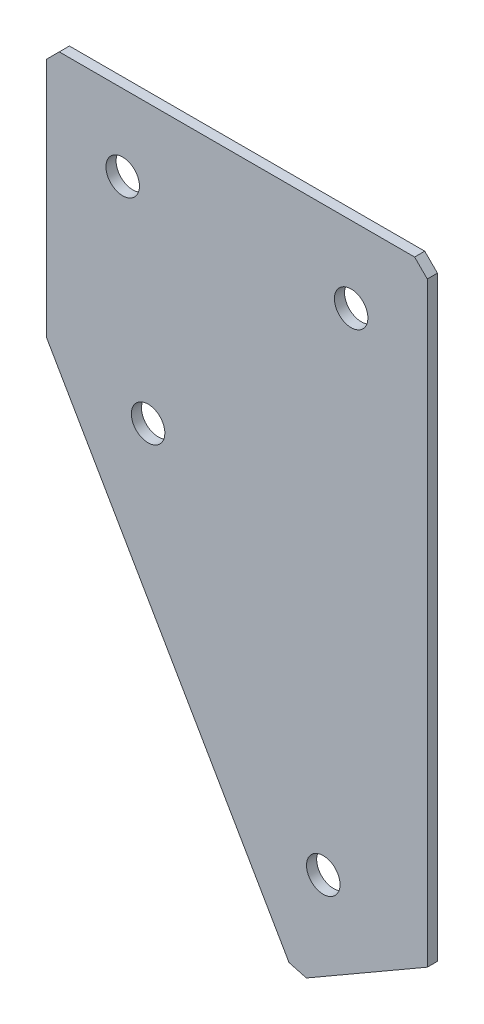
ISO-10303-21;
HEADER;
FILE_DESCRIPTION(('STEP AP214'),'2;1');
FILE_NAME('part.step','',(''),(''),'','','');
FILE_SCHEMA(('AUTOMOTIVE_DESIGN { 1 0 10303 214 1 1 1 1 }'));
ENDSEC;
DATA;
#1=APPLICATION_CONTEXT('core data for automotive mechanical design processes');
#2=APPLICATION_PROTOCOL_DEFINITION('international standard','automotive_design',2000,#1);
#3=PRODUCT_CONTEXT('',#1,'mechanical');
#4=PRODUCT('Part','Part','',(#3));
#5=PRODUCT_RELATED_PRODUCT_CATEGORY('part','',(#4));
#6=PRODUCT_DEFINITION_FORMATION('','',#4);
#7=PRODUCT_DEFINITION_CONTEXT('part definition',#1,'design');
#8=PRODUCT_DEFINITION('design','',#6,#7);
#9=PRODUCT_DEFINITION_SHAPE('','',#8);
#10=(LENGTH_UNIT() NAMED_UNIT(*) SI_UNIT(.MILLI.,.METRE.));
#11=(NAMED_UNIT(*) PLANE_ANGLE_UNIT() SI_UNIT($,.RADIAN.));
#12=(NAMED_UNIT(*) SI_UNIT($,.STERADIAN.) SOLID_ANGLE_UNIT());
#13=UNCERTAINTY_MEASURE_WITH_UNIT(LENGTH_MEASURE(1.E-05),#10,'distance_accuracy_value','');
#14=(GEOMETRIC_REPRESENTATION_CONTEXT(3) GLOBAL_UNCERTAINTY_ASSIGNED_CONTEXT((#13)) GLOBAL_UNIT_ASSIGNED_CONTEXT((#10,
#11,#12)) REPRESENTATION_CONTEXT('',''));
#15=CARTESIAN_POINT('',(0.,0.,0.));
#16=DIRECTION('',(0.,0.,1.));
#17=DIRECTION('',(1.,0.,0.));
#18=AXIS2_PLACEMENT_3D('',#15,#16,#17);
#19=CARTESIAN_POINT('',(0.,0.,-2.));
#20=DIRECTION('',(1.,0.,0.));
#21=DIRECTION('',(0.,0.,-1.));
#22=AXIS2_PLACEMENT_3D('',#19,#20,#21);
#23=PLANE('',#22);
#24=DIRECTION('',(0.,1.,0.));
#25=VECTOR('',#24,1.);
#26=CARTESIAN_POINT('',(0.,0.,0.));
#27=LINE('',#26,#25);
#28=CARTESIAN_POINT('',(0.,-50.,0.));
#29=VERTEX_POINT('',#28);
#30=CARTESIAN_POINT('',(0.,-2.50000000000003,0.));
#31=VERTEX_POINT('',#30);
#32=EDGE_CURVE('E130',#29,#31,#27,.T.);
#33=ORIENTED_EDGE('',*,*,#32,.T.);
#34=DIRECTION('',(0.,0.,-1.));
#35=VECTOR('',#34,1.);
#36=CARTESIAN_POINT('',(0.,-2.50000000000003,-2.));
#37=LINE('',#36,#35);
#38=CARTESIAN_POINT('',(0.,-2.50000000000003,-2.));
#39=VERTEX_POINT('',#38);
#40=EDGE_CURVE('E11',#31,#39,#37,.T.);
#41=ORIENTED_EDGE('',*,*,#40,.T.);
#42=DIRECTION('',(0.,1.,0.));
#43=VECTOR('',#42,1.);
#44=CARTESIAN_POINT('',(0.,0.,-2.));
#45=LINE('',#44,#43);
#46=CARTESIAN_POINT('',(0.,-50.,-2.));
#47=VERTEX_POINT('',#46);
#48=EDGE_CURVE('E141',#47,#39,#45,.T.);
#49=ORIENTED_EDGE('',*,*,#48,.F.);
#50=DIRECTION('',(0.,0.,1.));
#51=VECTOR('',#50,1.);
#52=CARTESIAN_POINT('',(0.,-50.,-2.));
#53=LINE('',#52,#51);
#54=EDGE_CURVE('E120',#47,#29,#53,.T.);
#55=ORIENTED_EDGE('',*,*,#54,.T.);
#56=EDGE_LOOP('',(#33,#41,#49,#55));
#57=FACE_BOUND('',#56,.T.);
#58=ADVANCED_FACE('F37',(#57),#23,.F.);
#59=CARTESIAN_POINT('',(0.,0.,-2.));
#60=DIRECTION('',(0.,-1.,0.));
#61=DIRECTION('',(0.,0.,-1.));
#62=AXIS2_PLACEMENT_3D('',#59,#60,#61);
#63=PLANE('',#62);
#64=DIRECTION('',(1.,0.,0.));
#65=VECTOR('',#64,1.);
#66=CARTESIAN_POINT('',(0.,0.,0.));
#67=LINE('',#66,#65);
#68=CARTESIAN_POINT('',(2.50000000000003,0.,0.));
#69=VERTEX_POINT('',#68);
#70=CARTESIAN_POINT('',(72.5,0.,0.));
#71=VERTEX_POINT('',#70);
#72=EDGE_CURVE('E133',#69,#71,#67,.T.);
#73=ORIENTED_EDGE('',*,*,#72,.T.);
#74=DIRECTION('',(0.,0.,-1.));
#75=VECTOR('',#74,1.);
#76=CARTESIAN_POINT('',(72.5,0.,-2.));
#77=LINE('',#76,#75);
#78=CARTESIAN_POINT('',(72.5,0.,-2.));
#79=VERTEX_POINT('',#78);
#80=EDGE_CURVE('E45',#71,#79,#77,.T.);
#81=ORIENTED_EDGE('',*,*,#80,.T.);
#82=DIRECTION('',(1.,0.,0.));
#83=VECTOR('',#82,1.);
#84=CARTESIAN_POINT('',(0.,0.,-2.));
#85=LINE('',#84,#83);
#86=CARTESIAN_POINT('',(2.50000000000003,0.,-2.));
#87=VERTEX_POINT('',#86);
#88=EDGE_CURVE('E109',#87,#79,#85,.T.);
#89=ORIENTED_EDGE('',*,*,#88,.F.);
#90=DIRECTION('',(0.,0.,1.));
#91=VECTOR('',#90,1.);
#92=CARTESIAN_POINT('',(2.50000000000003,0.,-2.));
#93=LINE('',#92,#91);
#94=EDGE_CURVE('E160',#87,#69,#93,.T.);
#95=ORIENTED_EDGE('',*,*,#94,.T.);
#96=EDGE_LOOP('',(#73,#81,#89,#95));
#97=FACE_BOUND('',#96,.T.);
#98=ADVANCED_FACE('F164',(#97),#63,.F.);
#99=CARTESIAN_POINT('',(75.,0.,-2.));
#100=DIRECTION('',(-1.,0.,0.));
#101=DIRECTION('',(0.,-1.,0.));
#102=AXIS2_PLACEMENT_3D('',#99,#100,#101);
#103=PLANE('',#102);
#104=DIRECTION('',(0.,-1.,0.));
#105=VECTOR('',#104,1.);
#106=CARTESIAN_POINT('',(75.,0.,-2.));
#107=LINE('',#106,#105);
#108=CARTESIAN_POINT('',(75.,-2.50000000000002,-2.));
#109=VERTEX_POINT('',#108);
#110=CARTESIAN_POINT('',(75.0000000000002,-119.903810567667,-2.));
#111=VERTEX_POINT('',#110);
#112=EDGE_CURVE('E100',#109,#111,#107,.T.);
#113=ORIENTED_EDGE('',*,*,#112,.F.);
#114=DIRECTION('',(0.,0.,1.));
#115=VECTOR('',#114,1.);
#116=CARTESIAN_POINT('',(75.,-2.50000000000002,-2.));
#117=LINE('',#116,#115);
#118=CARTESIAN_POINT('',(75.,-2.50000000000002,0.));
#119=VERTEX_POINT('',#118);
#120=EDGE_CURVE('E158',#109,#119,#117,.T.);
#121=ORIENTED_EDGE('',*,*,#120,.T.);
#122=DIRECTION('',(0.,-1.,0.));
#123=VECTOR('',#122,1.);
#124=CARTESIAN_POINT('',(75.,0.,0.));
#125=LINE('',#124,#123);
#126=CARTESIAN_POINT('',(75.0000000000002,-119.903810567667,0.));
#127=VERTEX_POINT('',#126);
#128=EDGE_CURVE('E115',#119,#127,#125,.T.);
#129=ORIENTED_EDGE('',*,*,#128,.T.);
#130=DIRECTION('',(0.,0.,1.));
#131=VECTOR('',#130,1.);
#132=CARTESIAN_POINT('',(75.0000000000002,-119.903810567667,-2.));
#133=LINE('',#132,#131);
#134=EDGE_CURVE('E112',#111,#127,#133,.T.);
#135=ORIENTED_EDGE('',*,*,#134,.F.);
#136=EDGE_LOOP('',(#113,#121,#129,#135));
#137=FACE_BOUND('',#136,.T.);
#138=ADVANCED_FACE('F113',(#137),#103,.F.);
#139=CARTESIAN_POINT('',(49.019237886467,-134.903810567667,-2.));
#140=DIRECTION('',(-0.499999999999997,0.86602540378444,0.));
#141=DIRECTION('',(-0.86602540378444,-0.499999999999997,0.));
#142=AXIS2_PLACEMENT_3D('',#139,#140,#141);
#143=PLANE('',#142);
#144=DIRECTION('',(-0.86602540378444,-0.499999999999997,0.));
#145=VECTOR('',#144,1.);
#146=CARTESIAN_POINT('',(49.019237886467,-134.903810567667,0.));
#147=LINE('',#146,#145);
#148=CARTESIAN_POINT('',(51.1843013959282,-133.653810567667,0.));
#149=VERTEX_POINT('',#148);
#150=EDGE_CURVE('E137',#127,#149,#147,.T.);
#151=ORIENTED_EDGE('',*,*,#150,.T.);
#152=DIRECTION('',(0.,0.,-1.));
#153=VECTOR('',#152,1.);
#154=CARTESIAN_POINT('',(51.1843013959282,-133.653810567667,-2.));
#155=LINE('',#154,#153);
#156=CARTESIAN_POINT('',(51.1843013959282,-133.653810567667,-2.));
#157=VERTEX_POINT('',#156);
#158=EDGE_CURVE('E124',#149,#157,#155,.T.);
#159=ORIENTED_EDGE('',*,*,#158,.T.);
#160=DIRECTION('',(-0.86602540378444,-0.499999999999997,0.));
#161=VECTOR('',#160,1.);
#162=CARTESIAN_POINT('',(49.019237886467,-134.903810567667,-2.));
#163=LINE('',#162,#161);
#164=EDGE_CURVE('E104',#111,#157,#163,.T.);
#165=ORIENTED_EDGE('',*,*,#164,.F.);
#166=ORIENTED_EDGE('',*,*,#134,.T.);
#167=EDGE_LOOP('',(#151,#159,#165,#166));
#168=FACE_BOUND('',#167,.T.);
#169=ADVANCED_FACE('F122',(#168),#143,.F.);
#170=CARTESIAN_POINT('',(0.,-50.,-2.));
#171=DIRECTION('',(0.86602540378444,0.499999999999998,0.));
#172=DIRECTION('',(-0.499999999999998,0.86602540378444,0.));
#173=AXIS2_PLACEMENT_3D('',#170,#171,#172);
#174=PLANE('',#173);
#175=DIRECTION('',(-0.499999999999998,0.86602540378444,0.));
#176=VECTOR('',#175,1.);
#177=CARTESIAN_POINT('',(0.,-50.,-2.));
#178=LINE('',#177,#176);
#179=CARTESIAN_POINT('',(47.769237886467,-132.738747058205,-2.));
#180=VERTEX_POINT('',#179);
#181=EDGE_CURVE('E125',#180,#47,#178,.T.);
#182=ORIENTED_EDGE('',*,*,#181,.F.);
#183=DIRECTION('',(0.,0.,1.));
#184=VECTOR('',#183,1.);
#185=CARTESIAN_POINT('',(47.769237886467,-132.738747058205,-2.));
#186=LINE('',#185,#184);
#187=CARTESIAN_POINT('',(47.769237886467,-132.738747058205,0.));
#188=VERTEX_POINT('',#187);
#189=EDGE_CURVE('E119',#180,#188,#186,.T.);
#190=ORIENTED_EDGE('',*,*,#189,.T.);
#191=DIRECTION('',(-0.499999999999998,0.86602540378444,0.));
#192=VECTOR('',#191,1.);
#193=CARTESIAN_POINT('',(0.,-50.,0.));
#194=LINE('',#193,#192);
#195=EDGE_CURVE('E139',#188,#29,#194,.T.);
#196=ORIENTED_EDGE('',*,*,#195,.T.);
#197=ORIENTED_EDGE('',*,*,#54,.F.);
#198=EDGE_LOOP('',(#182,#190,#196,#197));
#199=FACE_BOUND('',#198,.T.);
#200=ADVANCED_FACE('F194',(#199),#174,.F.);
#201=CARTESIAN_POINT('',(0.,0.,-2.));
#202=DIRECTION('',(0.,0.,1.));
#203=DIRECTION('',(1.,0.,0.));
#204=AXIS2_PLACEMENT_3D('',#201,#202,#203);
#205=PLANE('',#204);
#206=CARTESIAN_POINT('',(15.,-15.,-2.));
#207=DIRECTION('',(0.,0.,-1.));
#208=DIRECTION('',(0.,1.,0.));
#209=AXIS2_PLACEMENT_3D('',#206,#207,#208);
#210=CIRCLE('',#209,3.3);
#211=CARTESIAN_POINT('',(15.,-11.7,-2.));
#212=VERTEX_POINT('',#211);
#213=EDGE_CURVE('E226',#212,#212,#210,.T.);
#214=ORIENTED_EDGE('',*,*,#213,.F.);
#215=EDGE_LOOP('',(#214));
#216=FACE_BOUND('',#215,.T.);
#217=CARTESIAN_POINT('',(60.,-15.,-2.));
#218=DIRECTION('',(0.,0.,-1.));
#219=DIRECTION('',(0.,1.,0.));
#220=AXIS2_PLACEMENT_3D('',#217,#218,#219);
#221=CIRCLE('',#220,3.3);
#222=CARTESIAN_POINT('',(60.,-11.7,-2.));
#223=VERTEX_POINT('',#222);
#224=EDGE_CURVE('E228',#223,#223,#221,.T.);
#225=ORIENTED_EDGE('',*,*,#224,.F.);
#226=EDGE_LOOP('',(#225));
#227=FACE_BOUND('',#226,.T.);
#228=CARTESIAN_POINT('',(20.,-54.641016151378,-2.));
#229=DIRECTION('',(0.,0.,-1.));
#230=DIRECTION('',(0.,1.,0.));
#231=AXIS2_PLACEMENT_3D('',#228,#229,#230);
#232=CIRCLE('',#231,3.3);
#233=CARTESIAN_POINT('',(20.,-51.341016151378,-2.));
#234=VERTEX_POINT('',#233);
#235=EDGE_CURVE('E236',#234,#234,#232,.T.);
#236=ORIENTED_EDGE('',*,*,#235,.F.);
#237=EDGE_LOOP('',(#236));
#238=FACE_BOUND('',#237,.T.);
#239=CARTESIAN_POINT('',(54.5096189432336,-114.4134295109,-2.00000000000001));
#240=DIRECTION('',(0.,0.,-1.));
#241=DIRECTION('',(0.,1.,0.));
#242=AXIS2_PLACEMENT_3D('',#239,#240,#241);
#243=CIRCLE('',#242,3.3);
#244=CARTESIAN_POINT('',(54.5096189432336,-111.1134295109,-2.00000000000001));
#245=VERTEX_POINT('',#244);
#246=EDGE_CURVE('E242',#245,#245,#243,.T.);
#247=ORIENTED_EDGE('',*,*,#246,.F.);
#248=EDGE_LOOP('',(#247));
#249=FACE_BOUND('',#248,.T.);
#250=ORIENTED_EDGE('',*,*,#164,.T.);
#251=DIRECTION('',(0.965925826289068,-0.258819045102524,0.));
#252=VECTOR('',#251,1.);
#253=CARTESIAN_POINT('',(47.769237886467,-132.738747058205,-2.));
#254=LINE('',#253,#252);
#255=EDGE_CURVE('E156',#157,#180,#254,.F.);
#256=ORIENTED_EDGE('',*,*,#255,.T.);
#257=ORIENTED_EDGE('',*,*,#181,.T.);
#258=ORIENTED_EDGE('',*,*,#48,.T.);
#259=DIRECTION('',(-0.707106781186548,-0.707106781186548,0.));
#260=VECTOR('',#259,1.);
#261=CARTESIAN_POINT('',(2.50000000000003,0.,-2.));
#262=LINE('',#261,#260);
#263=EDGE_CURVE('E153',#39,#87,#262,.F.);
#264=ORIENTED_EDGE('',*,*,#263,.T.);
#265=ORIENTED_EDGE('',*,*,#88,.T.);
#266=DIRECTION('',(-0.707106781186548,0.707106781186548,0.));
#267=VECTOR('',#266,1.);
#268=CARTESIAN_POINT('',(75.,-2.50000000000002,-2.));
#269=LINE('',#268,#267);
#270=EDGE_CURVE('E52',#79,#109,#269,.F.);
#271=ORIENTED_EDGE('',*,*,#270,.T.);
#272=ORIENTED_EDGE('',*,*,#112,.T.);
#273=EDGE_LOOP('',(#250,#256,#257,#258,#264,#265,#271,#272));
#274=FACE_BOUND('',#273,.T.);
#275=ADVANCED_FACE('F102',(#216,#227,#238,#249,#274),#205,.F.);
#276=CARTESIAN_POINT('',(0.,0.,0.));
#277=DIRECTION('',(0.,0.,1.));
#278=DIRECTION('',(1.,0.,0.));
#279=AXIS2_PLACEMENT_3D('',#276,#277,#278);
#280=PLANE('',#279);
#281=CARTESIAN_POINT('',(15.,-15.,0.));
#282=DIRECTION('',(0.,0.,-1.));
#283=DIRECTION('',(0.,1.,0.));
#284=AXIS2_PLACEMENT_3D('',#281,#282,#283);
#285=CIRCLE('',#284,3.3);
#286=CARTESIAN_POINT('',(15.,-11.7,0.));
#287=VERTEX_POINT('',#286);
#288=EDGE_CURVE('E223',#287,#287,#285,.T.);
#289=ORIENTED_EDGE('',*,*,#288,.T.);
#290=EDGE_LOOP('',(#289));
#291=FACE_BOUND('',#290,.T.);
#292=CARTESIAN_POINT('',(60.,-15.,0.));
#293=DIRECTION('',(0.,0.,-1.));
#294=DIRECTION('',(0.,1.,0.));
#295=AXIS2_PLACEMENT_3D('',#292,#293,#294);
#296=CIRCLE('',#295,3.3);
#297=CARTESIAN_POINT('',(60.,-11.7,0.));
#298=VERTEX_POINT('',#297);
#299=EDGE_CURVE('E233',#298,#298,#296,.T.);
#300=ORIENTED_EDGE('',*,*,#299,.T.);
#301=EDGE_LOOP('',(#300));
#302=FACE_BOUND('',#301,.T.);
#303=CARTESIAN_POINT('',(20.,-54.641016151378,0.));
#304=DIRECTION('',(0.,0.,-1.));
#305=DIRECTION('',(0.,1.,0.));
#306=AXIS2_PLACEMENT_3D('',#303,#304,#305);
#307=CIRCLE('',#306,3.3);
#308=CARTESIAN_POINT('',(20.,-51.341016151378,0.));
#309=VERTEX_POINT('',#308);
#310=EDGE_CURVE('E239',#309,#309,#307,.T.);
#311=ORIENTED_EDGE('',*,*,#310,.T.);
#312=EDGE_LOOP('',(#311));
#313=FACE_BOUND('',#312,.T.);
#314=CARTESIAN_POINT('',(54.5096189432336,-114.4134295109,0.));
#315=DIRECTION('',(0.,0.,-1.));
#316=DIRECTION('',(0.,1.,0.));
#317=AXIS2_PLACEMENT_3D('',#314,#315,#316);
#318=CIRCLE('',#317,3.3);
#319=CARTESIAN_POINT('',(54.5096189432336,-111.1134295109,0.));
#320=VERTEX_POINT('',#319);
#321=EDGE_CURVE('E134',#320,#320,#318,.T.);
#322=ORIENTED_EDGE('',*,*,#321,.T.);
#323=EDGE_LOOP('',(#322));
#324=FACE_BOUND('',#323,.T.);
#325=ORIENTED_EDGE('',*,*,#195,.F.);
#326=DIRECTION('',(-0.965925826289068,0.258819045102524,0.));
#327=VECTOR('',#326,1.);
#328=CARTESIAN_POINT('',(-29.9847545858694,-111.904627566947,0.));
#329=LINE('',#328,#327);
#330=EDGE_CURVE('E150',#188,#149,#329,.F.);
#331=ORIENTED_EDGE('',*,*,#330,.T.);
#332=ORIENTED_EDGE('',*,*,#150,.F.);
#333=ORIENTED_EDGE('',*,*,#128,.F.);
#334=DIRECTION('',(0.707106781186548,-0.707106781186548,0.));
#335=VECTOR('',#334,1.);
#336=CARTESIAN_POINT('',(36.25,36.25,0.));
#337=LINE('',#336,#335);
#338=EDGE_CURVE('E148',#119,#71,#337,.F.);
#339=ORIENTED_EDGE('',*,*,#338,.T.);
#340=ORIENTED_EDGE('',*,*,#72,.F.);
#341=DIRECTION('',(0.707106781186548,0.707106781186548,0.));
#342=VECTOR('',#341,1.);
#343=CARTESIAN_POINT('',(1.25000000000002,-1.25000000000002,0.));
#344=LINE('',#343,#342);
#345=EDGE_CURVE('E146',#69,#31,#344,.F.);
#346=ORIENTED_EDGE('',*,*,#345,.T.);
#347=ORIENTED_EDGE('',*,*,#32,.F.);
#348=EDGE_LOOP('',(#325,#331,#332,#333,#339,#340,#346,#347));
#349=FACE_BOUND('',#348,.T.);
#350=ADVANCED_FACE('F169',(#291,#302,#313,#324,#349),#280,.T.);
#351=CARTESIAN_POINT('',(54.5096189432336,-114.4134295109,-2.00000000000001));
#352=DIRECTION('',(0.,0.,-1.));
#353=DIRECTION('',(0.,1.,0.));
#354=AXIS2_PLACEMENT_3D('',#351,#352,#353);
#355=CYLINDRICAL_SURFACE('',#354,3.3);
#356=ORIENTED_EDGE('',*,*,#321,.F.);
#357=EDGE_LOOP('',(#356));
#358=FACE_BOUND('',#357,.T.);
#359=ORIENTED_EDGE('',*,*,#246,.T.);
#360=EDGE_LOOP('',(#359));
#361=FACE_BOUND('',#360,.T.);
#362=ADVANCED_FACE('F200',(#358,#361),#355,.F.);
#363=CARTESIAN_POINT('',(20.,-54.641016151378,-2.));
#364=DIRECTION('',(0.,0.,-1.));
#365=DIRECTION('',(0.,1.,0.));
#366=AXIS2_PLACEMENT_3D('',#363,#364,#365);
#367=CYLINDRICAL_SURFACE('',#366,3.3);
#368=ORIENTED_EDGE('',*,*,#310,.F.);
#369=EDGE_LOOP('',(#368));
#370=FACE_BOUND('',#369,.T.);
#371=ORIENTED_EDGE('',*,*,#235,.T.);
#372=EDGE_LOOP('',(#371));
#373=FACE_BOUND('',#372,.T.);
#374=ADVANCED_FACE('F207',(#370,#373),#367,.F.);
#375=CARTESIAN_POINT('',(60.,-15.,-2.));
#376=DIRECTION('',(0.,0.,-1.));
#377=DIRECTION('',(0.,1.,0.));
#378=AXIS2_PLACEMENT_3D('',#375,#376,#377);
#379=CYLINDRICAL_SURFACE('',#378,3.3);
#380=ORIENTED_EDGE('',*,*,#299,.F.);
#381=EDGE_LOOP('',(#380));
#382=FACE_BOUND('',#381,.T.);
#383=ORIENTED_EDGE('',*,*,#224,.T.);
#384=EDGE_LOOP('',(#383));
#385=FACE_BOUND('',#384,.T.);
#386=ADVANCED_FACE('F211',(#382,#385),#379,.F.);
#387=CARTESIAN_POINT('',(15.,-15.,-2.));
#388=DIRECTION('',(0.,0.,-1.));
#389=DIRECTION('',(0.,1.,0.));
#390=AXIS2_PLACEMENT_3D('',#387,#388,#389);
#391=CYLINDRICAL_SURFACE('',#390,3.3);
#392=ORIENTED_EDGE('',*,*,#288,.F.);
#393=EDGE_LOOP('',(#392));
#394=FACE_BOUND('',#393,.T.);
#395=ORIENTED_EDGE('',*,*,#213,.T.);
#396=EDGE_LOOP('',(#395));
#397=FACE_BOUND('',#396,.T.);
#398=ADVANCED_FACE('F179',(#394,#397),#391,.F.);
#399=CARTESIAN_POINT('',(47.769237886467,-132.738747058205,-2.));
#400=DIRECTION('',(0.258819045102524,0.965925826289068,0.));
#401=DIRECTION('',(0.,0.,1.));
#402=AXIS2_PLACEMENT_3D('',#399,#400,#401);
#403=PLANE('',#402);
#404=ORIENTED_EDGE('',*,*,#255,.F.);
#405=ORIENTED_EDGE('',*,*,#158,.F.);
#406=ORIENTED_EDGE('',*,*,#330,.F.);
#407=ORIENTED_EDGE('',*,*,#189,.F.);
#408=EDGE_LOOP('',(#404,#405,#406,#407));
#409=FACE_BOUND('',#408,.T.);
#410=ADVANCED_FACE('F174',(#409),#403,.F.);
#411=CARTESIAN_POINT('',(75.,-2.50000000000002,-2.));
#412=DIRECTION('',(-0.707106781186547,-0.707106781186547,0.));
#413=DIRECTION('',(0.,0.,1.));
#414=AXIS2_PLACEMENT_3D('',#411,#412,#413);
#415=PLANE('',#414);
#416=ORIENTED_EDGE('',*,*,#270,.F.);
#417=ORIENTED_EDGE('',*,*,#80,.F.);
#418=ORIENTED_EDGE('',*,*,#338,.F.);
#419=ORIENTED_EDGE('',*,*,#120,.F.);
#420=EDGE_LOOP('',(#416,#417,#418,#419));
#421=FACE_BOUND('',#420,.T.);
#422=ADVANCED_FACE('F172',(#421),#415,.F.);
#423=CARTESIAN_POINT('',(2.50000000000003,0.,-2.));
#424=DIRECTION('',(0.707106781186547,-0.707106781186547,0.));
#425=DIRECTION('',(0.,0.,1.));
#426=AXIS2_PLACEMENT_3D('',#423,#424,#425);
#427=PLANE('',#426);
#428=ORIENTED_EDGE('',*,*,#263,.F.);
#429=ORIENTED_EDGE('',*,*,#40,.F.);
#430=ORIENTED_EDGE('',*,*,#345,.F.);
#431=ORIENTED_EDGE('',*,*,#94,.F.);
#432=EDGE_LOOP('',(#428,#429,#430,#431));
#433=FACE_BOUND('',#432,.T.);
#434=ADVANCED_FACE('F39',(#433),#427,.F.);
#435=CLOSED_SHELL('',(#58,#98,#138,#169,#200,#275,#350,#362,#374,#386,#398,#410,#422,#434));
#436=MANIFOLD_SOLID_BREP('B2',#435);
#437=ADVANCED_BREP_SHAPE_REPRESENTATION('',(#18,#436),#14);
#438=SHAPE_DEFINITION_REPRESENTATION(#9,#437);
ENDSEC;
END-ISO-10303-21;
